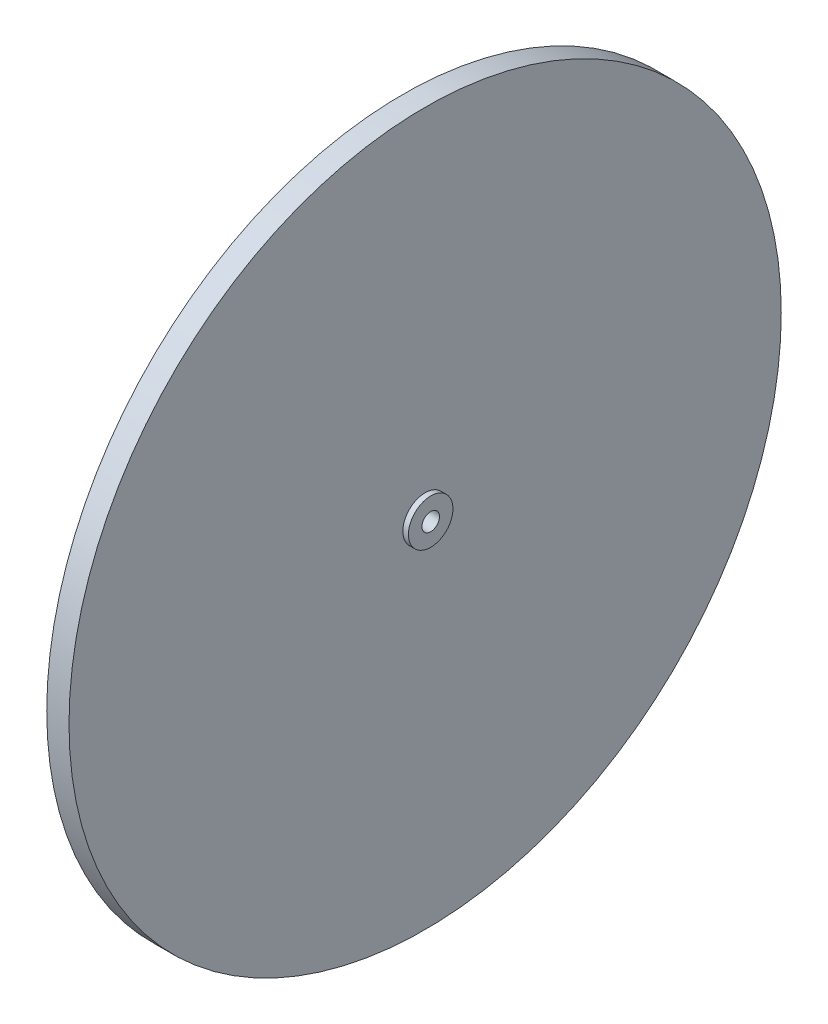
ISO-10303-21;
HEADER;
FILE_DESCRIPTION(('STEP AP214'),'2;1');
FILE_NAME('part.step','',(''),(''),'','','');
FILE_SCHEMA(('AUTOMOTIVE_DESIGN { 1 0 10303 214 1 1 1 1 }'));
ENDSEC;
DATA;
#1=APPLICATION_CONTEXT('core data for automotive mechanical design processes');
#2=APPLICATION_PROTOCOL_DEFINITION('international standard','automotive_design',2000,#1);
#3=PRODUCT_CONTEXT('',#1,'mechanical');
#4=PRODUCT('Part','Part','',(#3));
#5=PRODUCT_RELATED_PRODUCT_CATEGORY('part','',(#4));
#6=PRODUCT_DEFINITION_FORMATION('','',#4);
#7=PRODUCT_DEFINITION_CONTEXT('part definition',#1,'design');
#8=PRODUCT_DEFINITION('design','',#6,#7);
#9=PRODUCT_DEFINITION_SHAPE('','',#8);
#10=(LENGTH_UNIT() NAMED_UNIT(*) SI_UNIT(.MILLI.,.METRE.));
#11=(NAMED_UNIT(*) PLANE_ANGLE_UNIT() SI_UNIT($,.RADIAN.));
#12=(NAMED_UNIT(*) SI_UNIT($,.STERADIAN.) SOLID_ANGLE_UNIT());
#13=UNCERTAINTY_MEASURE_WITH_UNIT(LENGTH_MEASURE(1.E-05),#10,'distance_accuracy_value','');
#14=(GEOMETRIC_REPRESENTATION_CONTEXT(3) GLOBAL_UNCERTAINTY_ASSIGNED_CONTEXT((#13)) GLOBAL_UNIT_ASSIGNED_CONTEXT((#10,
#11,#12)) REPRESENTATION_CONTEXT('',''));
#15=CARTESIAN_POINT('',(0.,0.,0.));
#16=DIRECTION('',(0.,0.,1.));
#17=DIRECTION('',(1.,0.,0.));
#18=AXIS2_PLACEMENT_3D('',#15,#16,#17);
#19=CARTESIAN_POINT('',(0.,2.5,0.));
#20=DIRECTION('',(1.,0.,0.));
#21=DIRECTION('',(0.,0.,-1.));
#22=AXIS2_PLACEMENT_3D('',#19,#20,#21);
#23=PLANE('',#22);
#24=CARTESIAN_POINT('',(0.,0.,0.));
#25=DIRECTION('',(-1.,0.,0.));
#26=DIRECTION('',(0.,0.,1.));
#27=AXIS2_PLACEMENT_3D('',#24,#25,#26);
#28=CIRCLE('',#27,2.5);
#29=CARTESIAN_POINT('',(0.,0.,2.5));
#30=VERTEX_POINT('',#29);
#31=EDGE_CURVE('E59',#30,#30,#28,.T.);
#32=ORIENTED_EDGE('',*,*,#31,.F.);
#33=EDGE_LOOP('',(#32));
#34=FACE_BOUND('',#33,.T.);
#35=CARTESIAN_POINT('',(0.,0.,0.));
#36=DIRECTION('',(-1.,0.,0.));
#37=DIRECTION('',(0.,0.,1.));
#38=AXIS2_PLACEMENT_3D('',#35,#36,#37);
#39=CIRCLE('',#38,6.35);
#40=CARTESIAN_POINT('',(0.,0.,6.35));
#41=VERTEX_POINT('',#40);
#42=EDGE_CURVE('E10',#41,#41,#39,.T.);
#43=ORIENTED_EDGE('',*,*,#42,.T.);
#44=EDGE_LOOP('',(#43));
#45=FACE_BOUND('',#44,.T.);
#46=ADVANCED_FACE('F31',(#34,#45),#23,.F.);
#47=CARTESIAN_POINT('',(0.,0.,0.));
#48=DIRECTION('',(-1.,0.,0.));
#49=DIRECTION('',(0.,0.,1.));
#50=AXIS2_PLACEMENT_3D('',#47,#48,#49);
#51=CYLINDRICAL_SURFACE('',#50,6.35);
#52=ORIENTED_EDGE('',*,*,#42,.F.);
#53=EDGE_LOOP('',(#52));
#54=FACE_BOUND('',#53,.T.);
#55=CARTESIAN_POINT('',(1.5875,0.,0.));
#56=DIRECTION('',(-1.,0.,0.));
#57=DIRECTION('',(0.,0.,1.));
#58=AXIS2_PLACEMENT_3D('',#55,#56,#57);
#59=CIRCLE('',#58,6.35);
#60=CARTESIAN_POINT('',(1.5875,0.,6.35));
#61=VERTEX_POINT('',#60);
#62=EDGE_CURVE('E37',#61,#61,#59,.T.);
#63=ORIENTED_EDGE('',*,*,#62,.T.);
#64=EDGE_LOOP('',(#63));
#65=FACE_BOUND('',#64,.T.);
#66=ADVANCED_FACE('F66',(#54,#65),#51,.T.);
#67=CARTESIAN_POINT('',(1.5875,6.35,0.));
#68=DIRECTION('',(1.,0.,0.));
#69=DIRECTION('',(0.,0.,-1.));
#70=AXIS2_PLACEMENT_3D('',#67,#68,#69);
#71=PLANE('',#70);
#72=ORIENTED_EDGE('',*,*,#62,.F.);
#73=EDGE_LOOP('',(#72));
#74=FACE_BOUND('',#73,.T.);
#75=CARTESIAN_POINT('',(1.5875,0.,0.));
#76=DIRECTION('',(-1.,0.,0.));
#77=DIRECTION('',(0.,0.,1.));
#78=AXIS2_PLACEMENT_3D('',#75,#76,#77);
#79=CIRCLE('',#78,101.6);
#80=CARTESIAN_POINT('',(1.5875,0.,101.6));
#81=VERTEX_POINT('',#80);
#82=EDGE_CURVE('E41',#81,#81,#79,.T.);
#83=ORIENTED_EDGE('',*,*,#82,.T.);
#84=EDGE_LOOP('',(#83));
#85=FACE_BOUND('',#84,.T.);
#86=ADVANCED_FACE('F70',(#74,#85),#71,.F.);
#87=CARTESIAN_POINT('',(0.,0.,0.));
#88=DIRECTION('',(-1.,0.,0.));
#89=DIRECTION('',(0.,0.,1.));
#90=AXIS2_PLACEMENT_3D('',#87,#88,#89);
#91=CYLINDRICAL_SURFACE('',#90,101.6);
#92=ORIENTED_EDGE('',*,*,#82,.F.);
#93=EDGE_LOOP('',(#92));
#94=FACE_BOUND('',#93,.T.);
#95=CARTESIAN_POINT('',(7.9375,0.,0.));
#96=DIRECTION('',(-1.,0.,0.));
#97=DIRECTION('',(0.,0.,1.));
#98=AXIS2_PLACEMENT_3D('',#95,#96,#97);
#99=CIRCLE('',#98,101.6);
#100=CARTESIAN_POINT('',(7.9375,0.,101.6));
#101=VERTEX_POINT('',#100);
#102=EDGE_CURVE('E45',#101,#101,#99,.T.);
#103=ORIENTED_EDGE('',*,*,#102,.T.);
#104=EDGE_LOOP('',(#103));
#105=FACE_BOUND('',#104,.T.);
#106=ADVANCED_FACE('F75',(#94,#105),#91,.T.);
#107=CARTESIAN_POINT('',(7.9375,101.6,0.));
#108=DIRECTION('',(-1.,0.,0.));
#109=DIRECTION('',(0.,0.,1.));
#110=AXIS2_PLACEMENT_3D('',#107,#108,#109);
#111=PLANE('',#110);
#112=ORIENTED_EDGE('',*,*,#102,.F.);
#113=EDGE_LOOP('',(#112));
#114=FACE_BOUND('',#113,.T.);
#115=CARTESIAN_POINT('',(7.9375,0.,0.));
#116=DIRECTION('',(-1.,0.,0.));
#117=DIRECTION('',(0.,0.,1.));
#118=AXIS2_PLACEMENT_3D('',#115,#116,#117);
#119=CIRCLE('',#118,6.35);
#120=CARTESIAN_POINT('',(7.9375,0.,6.35));
#121=VERTEX_POINT('',#120);
#122=EDGE_CURVE('E50',#121,#121,#119,.T.);
#123=ORIENTED_EDGE('',*,*,#122,.T.);
#124=EDGE_LOOP('',(#123));
#125=FACE_BOUND('',#124,.T.);
#126=ADVANCED_FACE('F81',(#114,#125),#111,.F.);
#127=CARTESIAN_POINT('',(0.,0.,0.));
#128=DIRECTION('',(-1.,0.,0.));
#129=DIRECTION('',(0.,0.,1.));
#130=AXIS2_PLACEMENT_3D('',#127,#128,#129);
#131=CYLINDRICAL_SURFACE('',#130,6.35);
#132=ORIENTED_EDGE('',*,*,#122,.F.);
#133=EDGE_LOOP('',(#132));
#134=FACE_BOUND('',#133,.T.);
#135=CARTESIAN_POINT('',(9.525,0.,0.));
#136=DIRECTION('',(-1.,0.,0.));
#137=DIRECTION('',(0.,0.,1.));
#138=AXIS2_PLACEMENT_3D('',#135,#136,#137);
#139=CIRCLE('',#138,6.35);
#140=CARTESIAN_POINT('',(9.525,0.,6.35));
#141=VERTEX_POINT('',#140);
#142=EDGE_CURVE('E53',#141,#141,#139,.T.);
#143=ORIENTED_EDGE('',*,*,#142,.T.);
#144=EDGE_LOOP('',(#143));
#145=FACE_BOUND('',#144,.T.);
#146=ADVANCED_FACE('F85',(#134,#145),#131,.T.);
#147=CARTESIAN_POINT('',(9.525,6.35,0.));
#148=DIRECTION('',(-1.,0.,0.));
#149=DIRECTION('',(0.,0.,1.));
#150=AXIS2_PLACEMENT_3D('',#147,#148,#149);
#151=PLANE('',#150);
#152=ORIENTED_EDGE('',*,*,#142,.F.);
#153=EDGE_LOOP('',(#152));
#154=FACE_BOUND('',#153,.T.);
#155=CARTESIAN_POINT('',(9.525,0.,0.));
#156=DIRECTION('',(-1.,0.,0.));
#157=DIRECTION('',(0.,0.,1.));
#158=AXIS2_PLACEMENT_3D('',#155,#156,#157);
#159=CIRCLE('',#158,2.5);
#160=CARTESIAN_POINT('',(9.525,0.,2.5));
#161=VERTEX_POINT('',#160);
#162=EDGE_CURVE('E56',#161,#161,#159,.T.);
#163=ORIENTED_EDGE('',*,*,#162,.T.);
#164=EDGE_LOOP('',(#163));
#165=FACE_BOUND('',#164,.T.);
#166=ADVANCED_FACE('F89',(#154,#165),#151,.F.);
#167=CARTESIAN_POINT('',(0.,0.,0.));
#168=DIRECTION('',(-1.,0.,0.));
#169=DIRECTION('',(0.,0.,1.));
#170=AXIS2_PLACEMENT_3D('',#167,#168,#169);
#171=CYLINDRICAL_SURFACE('',#170,2.5);
#172=ORIENTED_EDGE('',*,*,#162,.F.);
#173=EDGE_LOOP('',(#172));
#174=FACE_BOUND('',#173,.T.);
#175=ORIENTED_EDGE('',*,*,#31,.T.);
#176=EDGE_LOOP('',(#175));
#177=FACE_BOUND('',#176,.T.);
#178=ADVANCED_FACE('F63',(#174,#177),#171,.F.);
#179=CLOSED_SHELL('',(#46,#66,#86,#106,#126,#146,#166,#178));
#180=MANIFOLD_SOLID_BREP('B2',#179);
#181=ADVANCED_BREP_SHAPE_REPRESENTATION('',(#18,#180),#14);
#182=SHAPE_DEFINITION_REPRESENTATION(#9,#181);
ENDSEC;
END-ISO-10303-21;
